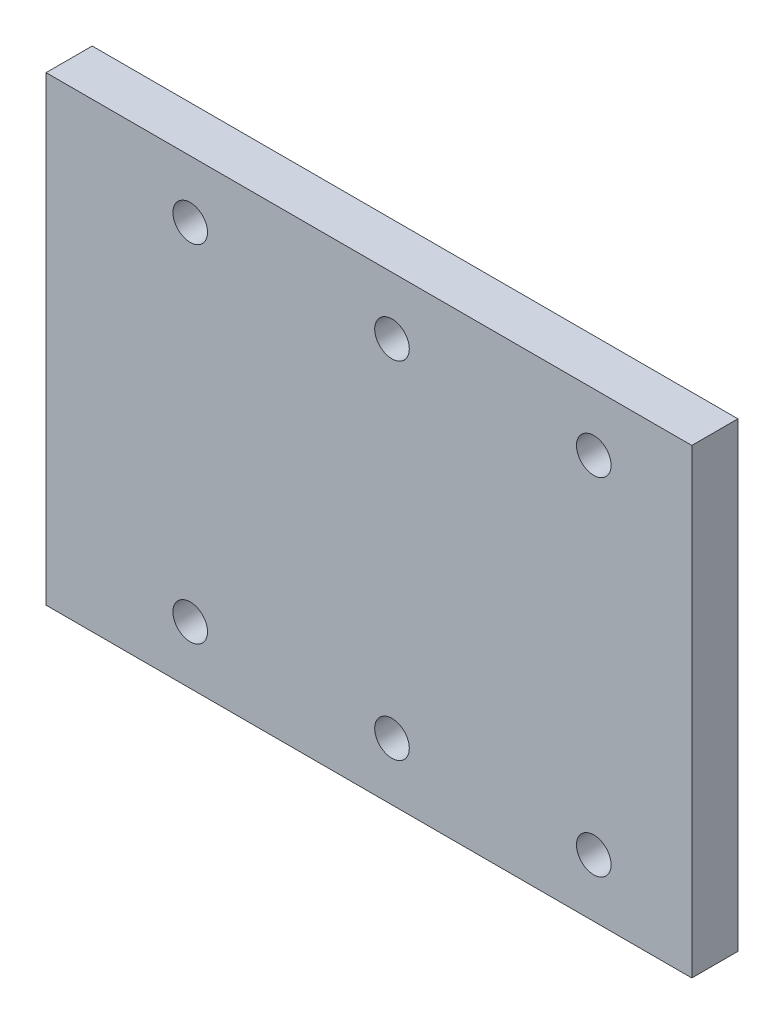
ISO-10303-21;
HEADER;
FILE_DESCRIPTION(('STEP AP214'),'2;1');
FILE_NAME('part.step','',(''),(''),'','','');
FILE_SCHEMA(('AUTOMOTIVE_DESIGN { 1 0 10303 214 1 1 1 1 }'));
ENDSEC;
DATA;
#1=APPLICATION_CONTEXT('core data for automotive mechanical design processes');
#2=APPLICATION_PROTOCOL_DEFINITION('international standard','automotive_design',2000,#1);
#3=PRODUCT_CONTEXT('',#1,'mechanical');
#4=PRODUCT('Part','Part','',(#3));
#5=PRODUCT_RELATED_PRODUCT_CATEGORY('part','',(#4));
#6=PRODUCT_DEFINITION_FORMATION('','',#4);
#7=PRODUCT_DEFINITION_CONTEXT('part definition',#1,'design');
#8=PRODUCT_DEFINITION('design','',#6,#7);
#9=PRODUCT_DEFINITION_SHAPE('','',#8);
#10=(LENGTH_UNIT() NAMED_UNIT(*) SI_UNIT(.MILLI.,.METRE.));
#11=(NAMED_UNIT(*) PLANE_ANGLE_UNIT() SI_UNIT($,.RADIAN.));
#12=(NAMED_UNIT(*) SI_UNIT($,.STERADIAN.) SOLID_ANGLE_UNIT());
#13=UNCERTAINTY_MEASURE_WITH_UNIT(LENGTH_MEASURE(1.E-05),#10,'distance_accuracy_value','');
#14=(GEOMETRIC_REPRESENTATION_CONTEXT(3) GLOBAL_UNCERTAINTY_ASSIGNED_CONTEXT((#13)) GLOBAL_UNIT_ASSIGNED_CONTEXT((#10,
#11,#12)) REPRESENTATION_CONTEXT('',''));
#15=CARTESIAN_POINT('',(0.,0.,0.));
#16=DIRECTION('',(0.,0.,1.));
#17=DIRECTION('',(1.,0.,0.));
#18=AXIS2_PLACEMENT_3D('',#15,#16,#17);
#19=CARTESIAN_POINT('',(0.,0.,4.));
#20=DIRECTION('',(0.,1.,0.));
#21=DIRECTION('',(0.,0.,1.));
#22=AXIS2_PLACEMENT_3D('',#19,#20,#21);
#23=PLANE('',#22);
#24=DIRECTION('',(0.,0.,-1.));
#25=VECTOR('',#24,1.);
#26=CARTESIAN_POINT('',(56.,0.,4.));
#27=LINE('',#26,#25);
#28=CARTESIAN_POINT('',(56.,0.,4.));
#29=VERTEX_POINT('',#28);
#30=CARTESIAN_POINT('',(56.,0.,0.));
#31=VERTEX_POINT('',#30);
#32=EDGE_CURVE('E44',#29,#31,#27,.T.);
#33=ORIENTED_EDGE('',*,*,#32,.F.);
#34=DIRECTION('',(1.,0.,0.));
#35=VECTOR('',#34,1.);
#36=CARTESIAN_POINT('',(56.,0.,4.));
#37=LINE('',#36,#35);
#38=CARTESIAN_POINT('',(0.,0.,4.));
#39=VERTEX_POINT('',#38);
#40=EDGE_CURVE('E109',#39,#29,#37,.T.);
#41=ORIENTED_EDGE('',*,*,#40,.F.);
#42=DIRECTION('',(0.,0.,-1.));
#43=VECTOR('',#42,1.);
#44=CARTESIAN_POINT('',(0.,0.,4.));
#45=LINE('',#44,#43);
#46=CARTESIAN_POINT('',(0.,0.,0.));
#47=VERTEX_POINT('',#46);
#48=EDGE_CURVE('E11',#39,#47,#45,.T.);
#49=ORIENTED_EDGE('',*,*,#48,.T.);
#50=DIRECTION('',(1.,0.,0.));
#51=VECTOR('',#50,1.);
#52=CARTESIAN_POINT('',(0.,0.,0.));
#53=LINE('',#52,#51);
#54=EDGE_CURVE('E90',#47,#31,#53,.T.);
#55=ORIENTED_EDGE('',*,*,#54,.T.);
#56=EDGE_LOOP('',(#33,#41,#49,#55));
#57=FACE_BOUND('',#56,.T.);
#58=ADVANCED_FACE('F35',(#57),#23,.F.);
#59=CARTESIAN_POINT('',(0.,0.,4.));
#60=DIRECTION('',(1.,0.,0.));
#61=DIRECTION('',(0.,0.,-1.));
#62=AXIS2_PLACEMENT_3D('',#59,#60,#61);
#63=PLANE('',#62);
#64=ORIENTED_EDGE('',*,*,#48,.F.);
#65=DIRECTION('',(0.,-1.,0.));
#66=VECTOR('',#65,1.);
#67=CARTESIAN_POINT('',(0.,0.,4.));
#68=LINE('',#67,#66);
#69=CARTESIAN_POINT('',(0.,40.,4.));
#70=VERTEX_POINT('',#69);
#71=EDGE_CURVE('E80',#70,#39,#68,.T.);
#72=ORIENTED_EDGE('',*,*,#71,.F.);
#73=DIRECTION('',(0.,0.,-1.));
#74=VECTOR('',#73,1.);
#75=CARTESIAN_POINT('',(0.,40.,4.));
#76=LINE('',#75,#74);
#77=CARTESIAN_POINT('',(0.,40.,0.));
#78=VERTEX_POINT('',#77);
#79=EDGE_CURVE('E75',#70,#78,#76,.T.);
#80=ORIENTED_EDGE('',*,*,#79,.T.);
#81=DIRECTION('',(0.,-1.,0.));
#82=VECTOR('',#81,1.);
#83=CARTESIAN_POINT('',(0.,0.,0.));
#84=LINE('',#83,#82);
#85=EDGE_CURVE('E85',#78,#47,#84,.T.);
#86=ORIENTED_EDGE('',*,*,#85,.T.);
#87=EDGE_LOOP('',(#64,#72,#80,#86));
#88=FACE_BOUND('',#87,.T.);
#89=ADVANCED_FACE('F37',(#88),#63,.F.);
#90=CARTESIAN_POINT('',(56.,0.,4.));
#91=DIRECTION('',(-1.,0.,0.));
#92=DIRECTION('',(0.,0.,1.));
#93=AXIS2_PLACEMENT_3D('',#90,#91,#92);
#94=PLANE('',#93);
#95=DIRECTION('',(0.,1.,0.));
#96=VECTOR('',#95,1.);
#97=CARTESIAN_POINT('',(56.,0.,4.));
#98=LINE('',#97,#96);
#99=CARTESIAN_POINT('',(56.,40.,4.));
#100=VERTEX_POINT('',#99);
#101=EDGE_CURVE('E104',#29,#100,#98,.T.);
#102=ORIENTED_EDGE('',*,*,#101,.F.);
#103=ORIENTED_EDGE('',*,*,#32,.T.);
#104=DIRECTION('',(0.,1.,0.));
#105=VECTOR('',#104,1.);
#106=CARTESIAN_POINT('',(56.,0.,0.));
#107=LINE('',#106,#105);
#108=CARTESIAN_POINT('',(56.,40.,0.));
#109=VERTEX_POINT('',#108);
#110=EDGE_CURVE('E67',#31,#109,#107,.T.);
#111=ORIENTED_EDGE('',*,*,#110,.T.);
#112=DIRECTION('',(0.,0.,-1.));
#113=VECTOR('',#112,1.);
#114=CARTESIAN_POINT('',(56.,40.,4.));
#115=LINE('',#114,#113);
#116=EDGE_CURVE('E77',#100,#109,#115,.T.);
#117=ORIENTED_EDGE('',*,*,#116,.F.);
#118=EDGE_LOOP('',(#102,#103,#111,#117));
#119=FACE_BOUND('',#118,.T.);
#120=ADVANCED_FACE('F103',(#119),#94,.F.);
#121=CARTESIAN_POINT('',(0.,40.,4.));
#122=DIRECTION('',(0.,-1.,0.));
#123=DIRECTION('',(0.,0.,-1.));
#124=AXIS2_PLACEMENT_3D('',#121,#122,#123);
#125=PLANE('',#124);
#126=DIRECTION('',(-1.,0.,0.));
#127=VECTOR('',#126,1.);
#128=CARTESIAN_POINT('',(0.,40.,0.));
#129=LINE('',#128,#127);
#130=EDGE_CURVE('E72',#109,#78,#129,.T.);
#131=ORIENTED_EDGE('',*,*,#130,.T.);
#132=ORIENTED_EDGE('',*,*,#79,.F.);
#133=DIRECTION('',(-1.,0.,0.));
#134=VECTOR('',#133,1.);
#135=CARTESIAN_POINT('',(0.,40.,4.));
#136=LINE('',#135,#134);
#137=EDGE_CURVE('E52',#100,#70,#136,.T.);
#138=ORIENTED_EDGE('',*,*,#137,.F.);
#139=ORIENTED_EDGE('',*,*,#116,.T.);
#140=EDGE_LOOP('',(#131,#132,#138,#139));
#141=FACE_BOUND('',#140,.T.);
#142=ADVANCED_FACE('F74',(#141),#125,.F.);
#143=CARTESIAN_POINT('',(0.,0.,4.));
#144=DIRECTION('',(0.,0.,-1.));
#145=DIRECTION('',(-1.,0.,0.));
#146=AXIS2_PLACEMENT_3D('',#143,#144,#145);
#147=PLANE('',#146);
#148=CARTESIAN_POINT('',(30.,5.,4.));
#149=DIRECTION('',(0.,0.,1.));
#150=DIRECTION('',(1.,0.,0.));
#151=AXIS2_PLACEMENT_3D('',#148,#149,#150);
#152=CIRCLE('',#151,1.5);
#153=CARTESIAN_POINT('',(31.5,5.,4.));
#154=VERTEX_POINT('',#153);
#155=EDGE_CURVE('E141',#154,#154,#152,.T.);
#156=ORIENTED_EDGE('',*,*,#155,.F.);
#157=EDGE_LOOP('',(#156));
#158=FACE_BOUND('',#157,.T.);
#159=CARTESIAN_POINT('',(12.5,5.,4.));
#160=DIRECTION('',(0.,0.,1.));
#161=DIRECTION('',(1.,0.,0.));
#162=AXIS2_PLACEMENT_3D('',#159,#160,#161);
#163=CIRCLE('',#162,1.5);
#164=CARTESIAN_POINT('',(14.,5.,4.));
#165=VERTEX_POINT('',#164);
#166=EDGE_CURVE('E135',#165,#165,#163,.T.);
#167=ORIENTED_EDGE('',*,*,#166,.F.);
#168=EDGE_LOOP('',(#167));
#169=FACE_BOUND('',#168,.T.);
#170=CARTESIAN_POINT('',(47.5,35.,4.));
#171=DIRECTION('',(0.,0.,1.));
#172=DIRECTION('',(1.,0.,0.));
#173=AXIS2_PLACEMENT_3D('',#170,#171,#172);
#174=CIRCLE('',#173,1.5);
#175=CARTESIAN_POINT('',(49.,35.,4.));
#176=VERTEX_POINT('',#175);
#177=EDGE_CURVE('E129',#176,#176,#174,.T.);
#178=ORIENTED_EDGE('',*,*,#177,.F.);
#179=EDGE_LOOP('',(#178));
#180=FACE_BOUND('',#179,.T.);
#181=CARTESIAN_POINT('',(30.,35.,4.));
#182=DIRECTION('',(0.,0.,1.));
#183=DIRECTION('',(1.,0.,0.));
#184=AXIS2_PLACEMENT_3D('',#181,#182,#183);
#185=CIRCLE('',#184,1.50000000000001);
#186=CARTESIAN_POINT('',(31.5,35.,4.));
#187=VERTEX_POINT('',#186);
#188=EDGE_CURVE('E123',#187,#187,#185,.T.);
#189=ORIENTED_EDGE('',*,*,#188,.F.);
#190=EDGE_LOOP('',(#189));
#191=FACE_BOUND('',#190,.T.);
#192=CARTESIAN_POINT('',(12.5,35.,4.));
#193=DIRECTION('',(0.,0.,1.));
#194=DIRECTION('',(1.,0.,0.));
#195=AXIS2_PLACEMENT_3D('',#192,#193,#194);
#196=CIRCLE('',#195,1.5);
#197=CARTESIAN_POINT('',(14.,35.,4.));
#198=VERTEX_POINT('',#197);
#199=EDGE_CURVE('E117',#198,#198,#196,.T.);
#200=ORIENTED_EDGE('',*,*,#199,.F.);
#201=EDGE_LOOP('',(#200));
#202=FACE_BOUND('',#201,.T.);
#203=CARTESIAN_POINT('',(47.5,5.,4.));
#204=DIRECTION('',(0.,0.,1.));
#205=DIRECTION('',(1.,0.,0.));
#206=AXIS2_PLACEMENT_3D('',#203,#204,#205);
#207=CIRCLE('',#206,1.5);
#208=CARTESIAN_POINT('',(49.,5.,4.));
#209=VERTEX_POINT('',#208);
#210=EDGE_CURVE('E95',#209,#209,#207,.T.);
#211=ORIENTED_EDGE('',*,*,#210,.F.);
#212=EDGE_LOOP('',(#211));
#213=FACE_BOUND('',#212,.T.);
#214=ORIENTED_EDGE('',*,*,#71,.T.);
#215=ORIENTED_EDGE('',*,*,#40,.T.);
#216=ORIENTED_EDGE('',*,*,#101,.T.);
#217=ORIENTED_EDGE('',*,*,#137,.T.);
#218=EDGE_LOOP('',(#214,#215,#216,#217));
#219=FACE_BOUND('',#218,.T.);
#220=ADVANCED_FACE('F111',(#158,#169,#180,#191,#202,#213,#219),#147,.F.);
#221=CARTESIAN_POINT('',(0.,0.,0.));
#222=DIRECTION('',(0.,0.,-1.));
#223=DIRECTION('',(-1.,0.,0.));
#224=AXIS2_PLACEMENT_3D('',#221,#222,#223);
#225=PLANE('',#224);
#226=CARTESIAN_POINT('',(30.,5.,0.));
#227=DIRECTION('',(0.,0.,1.));
#228=DIRECTION('',(1.,0.,0.));
#229=AXIS2_PLACEMENT_3D('',#226,#227,#228);
#230=CIRCLE('',#229,1.5);
#231=CARTESIAN_POINT('',(31.5,5.,0.));
#232=VERTEX_POINT('',#231);
#233=EDGE_CURVE('E115',#232,#232,#230,.T.);
#234=ORIENTED_EDGE('',*,*,#233,.T.);
#235=EDGE_LOOP('',(#234));
#236=FACE_BOUND('',#235,.T.);
#237=CARTESIAN_POINT('',(12.5,5.,0.));
#238=DIRECTION('',(0.,0.,1.));
#239=DIRECTION('',(1.,0.,0.));
#240=AXIS2_PLACEMENT_3D('',#237,#238,#239);
#241=CIRCLE('',#240,1.5);
#242=CARTESIAN_POINT('',(14.,5.,0.));
#243=VERTEX_POINT('',#242);
#244=EDGE_CURVE('E138',#243,#243,#241,.T.);
#245=ORIENTED_EDGE('',*,*,#244,.T.);
#246=EDGE_LOOP('',(#245));
#247=FACE_BOUND('',#246,.T.);
#248=CARTESIAN_POINT('',(47.5,35.,0.));
#249=DIRECTION('',(0.,0.,1.));
#250=DIRECTION('',(1.,0.,0.));
#251=AXIS2_PLACEMENT_3D('',#248,#249,#250);
#252=CIRCLE('',#251,1.5);
#253=CARTESIAN_POINT('',(49.,35.,0.));
#254=VERTEX_POINT('',#253);
#255=EDGE_CURVE('E132',#254,#254,#252,.T.);
#256=ORIENTED_EDGE('',*,*,#255,.T.);
#257=EDGE_LOOP('',(#256));
#258=FACE_BOUND('',#257,.T.);
#259=CARTESIAN_POINT('',(30.,35.,0.));
#260=DIRECTION('',(0.,0.,1.));
#261=DIRECTION('',(1.,0.,0.));
#262=AXIS2_PLACEMENT_3D('',#259,#260,#261);
#263=CIRCLE('',#262,1.50000000000001);
#264=CARTESIAN_POINT('',(31.5,35.,0.));
#265=VERTEX_POINT('',#264);
#266=EDGE_CURVE('E126',#265,#265,#263,.T.);
#267=ORIENTED_EDGE('',*,*,#266,.T.);
#268=EDGE_LOOP('',(#267));
#269=FACE_BOUND('',#268,.T.);
#270=CARTESIAN_POINT('',(12.5,35.,0.));
#271=DIRECTION('',(0.,0.,1.));
#272=DIRECTION('',(1.,0.,0.));
#273=AXIS2_PLACEMENT_3D('',#270,#271,#272);
#274=CIRCLE('',#273,1.5);
#275=CARTESIAN_POINT('',(14.,35.,0.));
#276=VERTEX_POINT('',#275);
#277=EDGE_CURVE('E120',#276,#276,#274,.T.);
#278=ORIENTED_EDGE('',*,*,#277,.T.);
#279=EDGE_LOOP('',(#278));
#280=FACE_BOUND('',#279,.T.);
#281=CARTESIAN_POINT('',(47.5,5.,0.));
#282=DIRECTION('',(0.,0.,1.));
#283=DIRECTION('',(1.,0.,0.));
#284=AXIS2_PLACEMENT_3D('',#281,#282,#283);
#285=CIRCLE('',#284,1.5);
#286=CARTESIAN_POINT('',(49.,5.,0.));
#287=VERTEX_POINT('',#286);
#288=EDGE_CURVE('E91',#287,#287,#285,.T.);
#289=ORIENTED_EDGE('',*,*,#288,.T.);
#290=EDGE_LOOP('',(#289));
#291=FACE_BOUND('',#290,.T.);
#292=ORIENTED_EDGE('',*,*,#85,.F.);
#293=ORIENTED_EDGE('',*,*,#130,.F.);
#294=ORIENTED_EDGE('',*,*,#110,.F.);
#295=ORIENTED_EDGE('',*,*,#54,.F.);
#296=EDGE_LOOP('',(#292,#293,#294,#295));
#297=FACE_BOUND('',#296,.T.);
#298=ADVANCED_FACE('F88',(#236,#247,#258,#269,#280,#291,#297),#225,.T.);
#299=CARTESIAN_POINT('',(47.5,5.,0.));
#300=DIRECTION('',(0.,0.,1.));
#301=DIRECTION('',(1.,0.,0.));
#302=AXIS2_PLACEMENT_3D('',#299,#300,#301);
#303=CYLINDRICAL_SURFACE('',#302,1.5);
#304=ORIENTED_EDGE('',*,*,#288,.F.);
#305=EDGE_LOOP('',(#304));
#306=FACE_BOUND('',#305,.T.);
#307=ORIENTED_EDGE('',*,*,#210,.T.);
#308=EDGE_LOOP('',(#307));
#309=FACE_BOUND('',#308,.T.);
#310=ADVANCED_FACE('F170',(#306,#309),#303,.F.);
#311=CARTESIAN_POINT('',(12.5,35.,0.));
#312=DIRECTION('',(0.,0.,1.));
#313=DIRECTION('',(1.,0.,0.));
#314=AXIS2_PLACEMENT_3D('',#311,#312,#313);
#315=CYLINDRICAL_SURFACE('',#314,1.5);
#316=ORIENTED_EDGE('',*,*,#277,.F.);
#317=EDGE_LOOP('',(#316));
#318=FACE_BOUND('',#317,.T.);
#319=ORIENTED_EDGE('',*,*,#199,.T.);
#320=EDGE_LOOP('',(#319));
#321=FACE_BOUND('',#320,.T.);
#322=ADVANCED_FACE('F172',(#318,#321),#315,.F.);
#323=CARTESIAN_POINT('',(30.,35.,0.));
#324=DIRECTION('',(0.,0.,1.));
#325=DIRECTION('',(1.,0.,0.));
#326=AXIS2_PLACEMENT_3D('',#323,#324,#325);
#327=CYLINDRICAL_SURFACE('',#326,1.50000000000001);
#328=ORIENTED_EDGE('',*,*,#266,.F.);
#329=EDGE_LOOP('',(#328));
#330=FACE_BOUND('',#329,.T.);
#331=ORIENTED_EDGE('',*,*,#188,.T.);
#332=EDGE_LOOP('',(#331));
#333=FACE_BOUND('',#332,.T.);
#334=ADVANCED_FACE('F179',(#330,#333),#327,.F.);
#335=CARTESIAN_POINT('',(47.5,35.,0.));
#336=DIRECTION('',(0.,0.,1.));
#337=DIRECTION('',(1.,0.,0.));
#338=AXIS2_PLACEMENT_3D('',#335,#336,#337);
#339=CYLINDRICAL_SURFACE('',#338,1.5);
#340=ORIENTED_EDGE('',*,*,#255,.F.);
#341=EDGE_LOOP('',(#340));
#342=FACE_BOUND('',#341,.T.);
#343=ORIENTED_EDGE('',*,*,#177,.T.);
#344=EDGE_LOOP('',(#343));
#345=FACE_BOUND('',#344,.T.);
#346=ADVANCED_FACE('F225',(#342,#345),#339,.F.);
#347=CARTESIAN_POINT('',(12.5,5.,0.));
#348=DIRECTION('',(0.,0.,1.));
#349=DIRECTION('',(1.,0.,0.));
#350=AXIS2_PLACEMENT_3D('',#347,#348,#349);
#351=CYLINDRICAL_SURFACE('',#350,1.5);
#352=ORIENTED_EDGE('',*,*,#244,.F.);
#353=EDGE_LOOP('',(#352));
#354=FACE_BOUND('',#353,.T.);
#355=ORIENTED_EDGE('',*,*,#166,.T.);
#356=EDGE_LOOP('',(#355));
#357=FACE_BOUND('',#356,.T.);
#358=ADVANCED_FACE('F153',(#354,#357),#351,.F.);
#359=CARTESIAN_POINT('',(30.,5.,0.));
#360=DIRECTION('',(0.,0.,1.));
#361=DIRECTION('',(1.,0.,0.));
#362=AXIS2_PLACEMENT_3D('',#359,#360,#361);
#363=CYLINDRICAL_SURFACE('',#362,1.5);
#364=ORIENTED_EDGE('',*,*,#233,.F.);
#365=EDGE_LOOP('',(#364));
#366=FACE_BOUND('',#365,.T.);
#367=ORIENTED_EDGE('',*,*,#155,.T.);
#368=EDGE_LOOP('',(#367));
#369=FACE_BOUND('',#368,.T.);
#370=ADVANCED_FACE('F150',(#366,#369),#363,.F.);
#371=CLOSED_SHELL('',(#58,#89,#120,#142,#220,#298,#310,#322,#334,#346,#358,#370));
#372=MANIFOLD_SOLID_BREP('B2',#371);
#373=ADVANCED_BREP_SHAPE_REPRESENTATION('',(#18,#372),#14);
#374=SHAPE_DEFINITION_REPRESENTATION(#9,#373);
ENDSEC;
END-ISO-10303-21;
